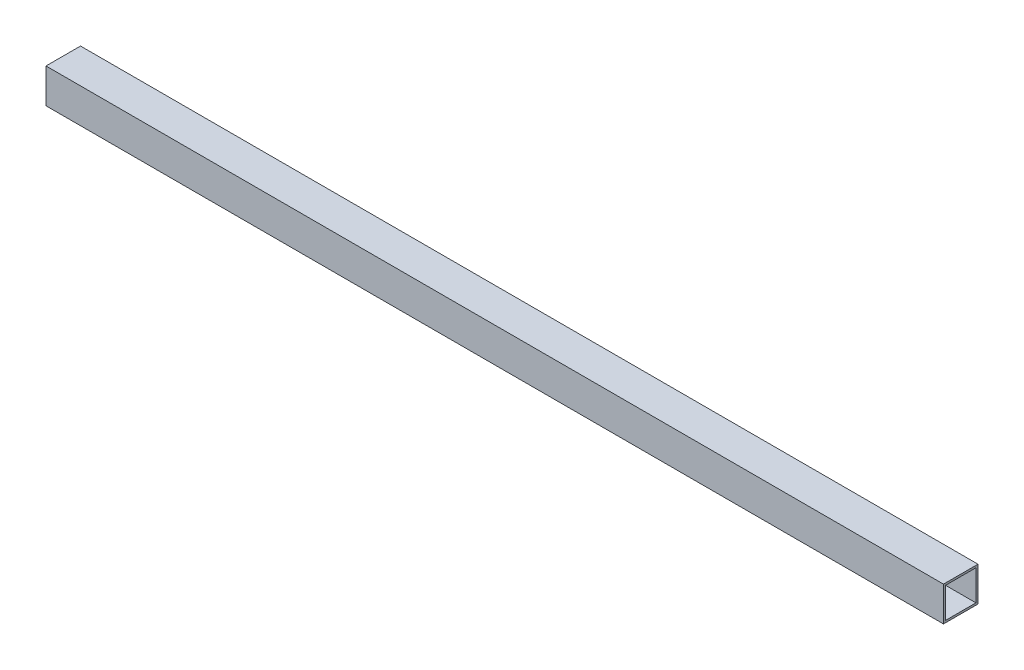
ISO-10303-21;
HEADER;
FILE_DESCRIPTION(('STEP AP214'),'2;1');
FILE_NAME('part.step','',(''),(''),'','','');
FILE_SCHEMA(('AUTOMOTIVE_DESIGN { 1 0 10303 214 1 1 1 1 }'));
ENDSEC;
DATA;
#1=APPLICATION_CONTEXT('core data for automotive mechanical design processes');
#2=APPLICATION_PROTOCOL_DEFINITION('international standard','automotive_design',2000,#1);
#3=PRODUCT_CONTEXT('',#1,'mechanical');
#4=PRODUCT('Part','Part','',(#3));
#5=PRODUCT_RELATED_PRODUCT_CATEGORY('part','',(#4));
#6=PRODUCT_DEFINITION_FORMATION('','',#4);
#7=PRODUCT_DEFINITION_CONTEXT('part definition',#1,'design');
#8=PRODUCT_DEFINITION('design','',#6,#7);
#9=PRODUCT_DEFINITION_SHAPE('','',#8);
#10=(LENGTH_UNIT() NAMED_UNIT(*) SI_UNIT(.MILLI.,.METRE.));
#11=(NAMED_UNIT(*) PLANE_ANGLE_UNIT() SI_UNIT($,.RADIAN.));
#12=(NAMED_UNIT(*) SI_UNIT($,.STERADIAN.) SOLID_ANGLE_UNIT());
#13=UNCERTAINTY_MEASURE_WITH_UNIT(LENGTH_MEASURE(1.E-05),#10,'distance_accuracy_value','');
#14=(GEOMETRIC_REPRESENTATION_CONTEXT(3) GLOBAL_UNCERTAINTY_ASSIGNED_CONTEXT((#13)) GLOBAL_UNIT_ASSIGNED_CONTEXT((#10,
#11,#12)) REPRESENTATION_CONTEXT('',''));
#15=CARTESIAN_POINT('',(0.,0.,0.));
#16=DIRECTION('',(0.,0.,1.));
#17=DIRECTION('',(1.,0.,0.));
#18=AXIS2_PLACEMENT_3D('',#15,#16,#17);
#19=CARTESIAN_POINT('',(520.,0.,0.));
#20=DIRECTION('',(-1.,0.,0.));
#21=DIRECTION('',(0.,0.,1.));
#22=AXIS2_PLACEMENT_3D('',#19,#20,#21);
#23=PLANE('',#22);
#24=DIRECTION('',(0.,1.,0.));
#25=VECTOR('',#24,1.);
#26=CARTESIAN_POINT('',(520.,-10.,-10.));
#27=LINE('',#26,#25);
#28=CARTESIAN_POINT('',(520.,-10.,-10.));
#29=VERTEX_POINT('',#28);
#30=CARTESIAN_POINT('',(520.,10.,-10.));
#31=VERTEX_POINT('',#30);
#32=EDGE_CURVE('E153',#29,#31,#27,.T.);
#33=ORIENTED_EDGE('',*,*,#32,.T.);
#34=DIRECTION('',(0.,0.,1.));
#35=VECTOR('',#34,1.);
#36=CARTESIAN_POINT('',(520.,10.,10.));
#37=LINE('',#36,#35);
#38=CARTESIAN_POINT('',(520.,10.,10.));
#39=VERTEX_POINT('',#38);
#40=EDGE_CURVE('E157',#31,#39,#37,.T.);
#41=ORIENTED_EDGE('',*,*,#40,.T.);
#42=DIRECTION('',(0.,-1.,0.));
#43=VECTOR('',#42,1.);
#44=CARTESIAN_POINT('',(520.,-10.,10.));
#45=LINE('',#44,#43);
#46=CARTESIAN_POINT('',(520.,-10.,10.));
#47=VERTEX_POINT('',#46);
#48=EDGE_CURVE('E161',#39,#47,#45,.T.);
#49=ORIENTED_EDGE('',*,*,#48,.T.);
#50=DIRECTION('',(0.,0.,-1.));
#51=VECTOR('',#50,1.);
#52=CARTESIAN_POINT('',(520.,-10.,10.));
#53=LINE('',#52,#51);
#54=EDGE_CURVE('E164',#47,#29,#53,.T.);
#55=ORIENTED_EDGE('',*,*,#54,.T.);
#56=EDGE_LOOP('',(#33,#41,#49,#55));
#57=FACE_BOUND('',#56,.T.);
#58=DIRECTION('',(0.,-1.,0.));
#59=VECTOR('',#58,1.);
#60=CARTESIAN_POINT('',(520.,-8.8,8.8));
#61=LINE('',#60,#59);
#62=CARTESIAN_POINT('',(520.,8.8,8.8));
#63=VERTEX_POINT('',#62);
#64=CARTESIAN_POINT('',(520.,-8.8,8.8));
#65=VERTEX_POINT('',#64);
#66=EDGE_CURVE('E105',#63,#65,#61,.T.);
#67=ORIENTED_EDGE('',*,*,#66,.F.);
#68=DIRECTION('',(0.,0.,1.));
#69=VECTOR('',#68,1.);
#70=CARTESIAN_POINT('',(520.,8.8,8.8));
#71=LINE('',#70,#69);
#72=CARTESIAN_POINT('',(520.,8.8,-8.8));
#73=VERTEX_POINT('',#72);
#74=EDGE_CURVE('E131',#73,#63,#71,.T.);
#75=ORIENTED_EDGE('',*,*,#74,.F.);
#76=DIRECTION('',(0.,1.,0.));
#77=VECTOR('',#76,1.);
#78=CARTESIAN_POINT('',(520.,-8.8,-8.8));
#79=LINE('',#78,#77);
#80=CARTESIAN_POINT('',(520.,-8.8,-8.8));
#81=VERTEX_POINT('',#80);
#82=EDGE_CURVE('E127',#81,#73,#79,.T.);
#83=ORIENTED_EDGE('',*,*,#82,.F.);
#84=DIRECTION('',(0.,0.,-1.));
#85=VECTOR('',#84,1.);
#86=CARTESIAN_POINT('',(520.,-8.8,8.8));
#87=LINE('',#86,#85);
#88=EDGE_CURVE('E114',#65,#81,#87,.T.);
#89=ORIENTED_EDGE('',*,*,#88,.F.);
#90=EDGE_LOOP('',(#67,#75,#83,#89));
#91=FACE_BOUND('',#90,.T.);
#92=ADVANCED_FACE('F39',(#57,#91),#23,.F.);
#93=CARTESIAN_POINT('',(0.,0.,0.));
#94=DIRECTION('',(-1.,0.,0.));
#95=DIRECTION('',(0.,0.,1.));
#96=AXIS2_PLACEMENT_3D('',#93,#94,#95);
#97=PLANE('',#96);
#98=DIRECTION('',(0.,1.,0.));
#99=VECTOR('',#98,1.);
#100=CARTESIAN_POINT('',(0.,-10.,-10.));
#101=LINE('',#100,#99);
#102=CARTESIAN_POINT('',(0.,-10.,-10.));
#103=VERTEX_POINT('',#102);
#104=CARTESIAN_POINT('',(0.,10.,-10.));
#105=VERTEX_POINT('',#104);
#106=EDGE_CURVE('E123',#103,#105,#101,.T.);
#107=ORIENTED_EDGE('',*,*,#106,.F.);
#108=DIRECTION('',(0.,0.,-1.));
#109=VECTOR('',#108,1.);
#110=CARTESIAN_POINT('',(0.,-10.,10.));
#111=LINE('',#110,#109);
#112=CARTESIAN_POINT('',(0.,-10.,10.));
#113=VERTEX_POINT('',#112);
#114=EDGE_CURVE('E158',#113,#103,#111,.T.);
#115=ORIENTED_EDGE('',*,*,#114,.F.);
#116=DIRECTION('',(0.,-1.,0.));
#117=VECTOR('',#116,1.);
#118=CARTESIAN_POINT('',(0.,-10.,10.));
#119=LINE('',#118,#117);
#120=CARTESIAN_POINT('',(0.,10.,10.));
#121=VERTEX_POINT('',#120);
#122=EDGE_CURVE('E174',#121,#113,#119,.T.);
#123=ORIENTED_EDGE('',*,*,#122,.F.);
#124=DIRECTION('',(0.,0.,1.));
#125=VECTOR('',#124,1.);
#126=CARTESIAN_POINT('',(0.,10.,10.));
#127=LINE('',#126,#125);
#128=EDGE_CURVE('E171',#105,#121,#127,.T.);
#129=ORIENTED_EDGE('',*,*,#128,.F.);
#130=EDGE_LOOP('',(#107,#115,#123,#129));
#131=FACE_BOUND('',#130,.T.);
#132=DIRECTION('',(0.,0.,1.));
#133=VECTOR('',#132,1.);
#134=CARTESIAN_POINT('',(0.,8.8,8.8));
#135=LINE('',#134,#133);
#136=CARTESIAN_POINT('',(0.,8.8,-8.8));
#137=VERTEX_POINT('',#136);
#138=CARTESIAN_POINT('',(0.,8.8,8.8));
#139=VERTEX_POINT('',#138);
#140=EDGE_CURVE('E115',#137,#139,#135,.T.);
#141=ORIENTED_EDGE('',*,*,#140,.T.);
#142=DIRECTION('',(0.,-1.,0.));
#143=VECTOR('',#142,1.);
#144=CARTESIAN_POINT('',(0.,-8.8,8.8));
#145=LINE('',#144,#143);
#146=CARTESIAN_POINT('',(0.,-8.8,8.8));
#147=VERTEX_POINT('',#146);
#148=EDGE_CURVE('E63',#139,#147,#145,.T.);
#149=ORIENTED_EDGE('',*,*,#148,.T.);
#150=DIRECTION('',(0.,0.,-1.));
#151=VECTOR('',#150,1.);
#152=CARTESIAN_POINT('',(0.,-8.8,8.8));
#153=LINE('',#152,#151);
#154=CARTESIAN_POINT('',(0.,-8.8,-8.8));
#155=VERTEX_POINT('',#154);
#156=EDGE_CURVE('E121',#147,#155,#153,.T.);
#157=ORIENTED_EDGE('',*,*,#156,.T.);
#158=DIRECTION('',(0.,1.,0.));
#159=VECTOR('',#158,1.);
#160=CARTESIAN_POINT('',(0.,-8.8,-8.8));
#161=LINE('',#160,#159);
#162=EDGE_CURVE('E140',#155,#137,#161,.T.);
#163=ORIENTED_EDGE('',*,*,#162,.T.);
#164=EDGE_LOOP('',(#141,#149,#157,#163));
#165=FACE_BOUND('',#164,.T.);
#166=ADVANCED_FACE('F197',(#131,#165),#97,.T.);
#167=CARTESIAN_POINT('',(520.,-10.,-10.));
#168=DIRECTION('',(0.,0.,1.));
#169=DIRECTION('',(1.,0.,0.));
#170=AXIS2_PLACEMENT_3D('',#167,#168,#169);
#171=PLANE('',#170);
#172=ORIENTED_EDGE('',*,*,#106,.T.);
#173=DIRECTION('',(-1.,0.,0.));
#174=VECTOR('',#173,1.);
#175=CARTESIAN_POINT('',(520.,10.,-10.));
#176=LINE('',#175,#174);
#177=EDGE_CURVE('E11',#31,#105,#176,.T.);
#178=ORIENTED_EDGE('',*,*,#177,.F.);
#179=ORIENTED_EDGE('',*,*,#32,.F.);
#180=DIRECTION('',(-1.,0.,0.));
#181=VECTOR('',#180,1.);
#182=CARTESIAN_POINT('',(520.,-10.,-10.));
#183=LINE('',#182,#181);
#184=EDGE_CURVE('E167',#29,#103,#183,.T.);
#185=ORIENTED_EDGE('',*,*,#184,.T.);
#186=EDGE_LOOP('',(#172,#178,#179,#185));
#187=FACE_BOUND('',#186,.T.);
#188=ADVANCED_FACE('F41',(#187),#171,.F.);
#189=CARTESIAN_POINT('',(520.,10.,10.));
#190=DIRECTION('',(0.,-1.,0.));
#191=DIRECTION('',(0.,0.,-1.));
#192=AXIS2_PLACEMENT_3D('',#189,#190,#191);
#193=PLANE('',#192);
#194=ORIENTED_EDGE('',*,*,#128,.T.);
#195=DIRECTION('',(-1.,0.,0.));
#196=VECTOR('',#195,1.);
#197=CARTESIAN_POINT('',(520.,10.,10.));
#198=LINE('',#197,#196);
#199=EDGE_CURVE('E48',#39,#121,#198,.T.);
#200=ORIENTED_EDGE('',*,*,#199,.F.);
#201=ORIENTED_EDGE('',*,*,#40,.F.);
#202=ORIENTED_EDGE('',*,*,#177,.T.);
#203=EDGE_LOOP('',(#194,#200,#201,#202));
#204=FACE_BOUND('',#203,.T.);
#205=ADVANCED_FACE('F207',(#204),#193,.F.);
#206=CARTESIAN_POINT('',(520.,-10.,10.));
#207=DIRECTION('',(0.,0.,-1.));
#208=DIRECTION('',(-1.,0.,0.));
#209=AXIS2_PLACEMENT_3D('',#206,#207,#208);
#210=PLANE('',#209);
#211=ORIENTED_EDGE('',*,*,#122,.T.);
#212=DIRECTION('',(-1.,0.,0.));
#213=VECTOR('',#212,1.);
#214=CARTESIAN_POINT('',(520.,-10.,10.));
#215=LINE('',#214,#213);
#216=EDGE_CURVE('E182',#47,#113,#215,.T.);
#217=ORIENTED_EDGE('',*,*,#216,.F.);
#218=ORIENTED_EDGE('',*,*,#48,.F.);
#219=ORIENTED_EDGE('',*,*,#199,.T.);
#220=EDGE_LOOP('',(#211,#217,#218,#219));
#221=FACE_BOUND('',#220,.T.);
#222=ADVANCED_FACE('F191',(#221),#210,.F.);
#223=CARTESIAN_POINT('',(520.,-10.,10.));
#224=DIRECTION('',(0.,1.,0.));
#225=DIRECTION('',(0.,0.,1.));
#226=AXIS2_PLACEMENT_3D('',#223,#224,#225);
#227=PLANE('',#226);
#228=ORIENTED_EDGE('',*,*,#114,.T.);
#229=ORIENTED_EDGE('',*,*,#184,.F.);
#230=ORIENTED_EDGE('',*,*,#54,.F.);
#231=ORIENTED_EDGE('',*,*,#216,.T.);
#232=EDGE_LOOP('',(#228,#229,#230,#231));
#233=FACE_BOUND('',#232,.T.);
#234=ADVANCED_FACE('F201',(#233),#227,.F.);
#235=CARTESIAN_POINT('',(520.,-8.8,8.8));
#236=DIRECTION('',(0.,0.,-1.));
#237=DIRECTION('',(-1.,0.,0.));
#238=AXIS2_PLACEMENT_3D('',#235,#236,#237);
#239=PLANE('',#238);
#240=ORIENTED_EDGE('',*,*,#148,.F.);
#241=DIRECTION('',(-1.,0.,0.));
#242=VECTOR('',#241,1.);
#243=CARTESIAN_POINT('',(520.,8.8,8.8));
#244=LINE('',#243,#242);
#245=EDGE_CURVE('E109',#63,#139,#244,.T.);
#246=ORIENTED_EDGE('',*,*,#245,.F.);
#247=ORIENTED_EDGE('',*,*,#66,.T.);
#248=DIRECTION('',(-1.,0.,0.));
#249=VECTOR('',#248,1.);
#250=CARTESIAN_POINT('',(520.,-8.8,8.8));
#251=LINE('',#250,#249);
#252=EDGE_CURVE('E108',#65,#147,#251,.T.);
#253=ORIENTED_EDGE('',*,*,#252,.T.);
#254=EDGE_LOOP('',(#240,#246,#247,#253));
#255=FACE_BOUND('',#254,.T.);
#256=ADVANCED_FACE('F107',(#255),#239,.T.);
#257=CARTESIAN_POINT('',(520.,-8.8,8.8));
#258=DIRECTION('',(0.,1.,0.));
#259=DIRECTION('',(0.,0.,1.));
#260=AXIS2_PLACEMENT_3D('',#257,#258,#259);
#261=PLANE('',#260);
#262=ORIENTED_EDGE('',*,*,#156,.F.);
#263=ORIENTED_EDGE('',*,*,#252,.F.);
#264=ORIENTED_EDGE('',*,*,#88,.T.);
#265=DIRECTION('',(-1.,0.,0.));
#266=VECTOR('',#265,1.);
#267=CARTESIAN_POINT('',(520.,-8.8,-8.8));
#268=LINE('',#267,#266);
#269=EDGE_CURVE('E124',#81,#155,#268,.T.);
#270=ORIENTED_EDGE('',*,*,#269,.T.);
#271=EDGE_LOOP('',(#262,#263,#264,#270));
#272=FACE_BOUND('',#271,.T.);
#273=ADVANCED_FACE('F118',(#272),#261,.T.);
#274=CARTESIAN_POINT('',(520.,-8.8,-8.8));
#275=DIRECTION('',(0.,0.,1.));
#276=DIRECTION('',(1.,0.,0.));
#277=AXIS2_PLACEMENT_3D('',#274,#275,#276);
#278=PLANE('',#277);
#279=ORIENTED_EDGE('',*,*,#162,.F.);
#280=ORIENTED_EDGE('',*,*,#269,.F.);
#281=ORIENTED_EDGE('',*,*,#82,.T.);
#282=DIRECTION('',(-1.,0.,0.));
#283=VECTOR('',#282,1.);
#284=CARTESIAN_POINT('',(520.,8.8,-8.8));
#285=LINE('',#284,#283);
#286=EDGE_CURVE('E55',#73,#137,#285,.T.);
#287=ORIENTED_EDGE('',*,*,#286,.T.);
#288=EDGE_LOOP('',(#279,#280,#281,#287));
#289=FACE_BOUND('',#288,.T.);
#290=ADVANCED_FACE('F230',(#289),#278,.T.);
#291=CARTESIAN_POINT('',(520.,8.8,8.8));
#292=DIRECTION('',(0.,-1.,0.));
#293=DIRECTION('',(0.,0.,-1.));
#294=AXIS2_PLACEMENT_3D('',#291,#292,#293);
#295=PLANE('',#294);
#296=ORIENTED_EDGE('',*,*,#140,.F.);
#297=ORIENTED_EDGE('',*,*,#286,.F.);
#298=ORIENTED_EDGE('',*,*,#74,.T.);
#299=ORIENTED_EDGE('',*,*,#245,.T.);
#300=EDGE_LOOP('',(#296,#297,#298,#299));
#301=FACE_BOUND('',#300,.T.);
#302=ADVANCED_FACE('F234',(#301),#295,.T.);
#303=CLOSED_SHELL('',(#92,#166,#188,#205,#222,#234,#256,#273,#290,#302));
#304=MANIFOLD_SOLID_BREP('B2',#303);
#305=ADVANCED_BREP_SHAPE_REPRESENTATION('',(#18,#304),#14);
#306=SHAPE_DEFINITION_REPRESENTATION(#9,#305);
ENDSEC;
END-ISO-10303-21;
